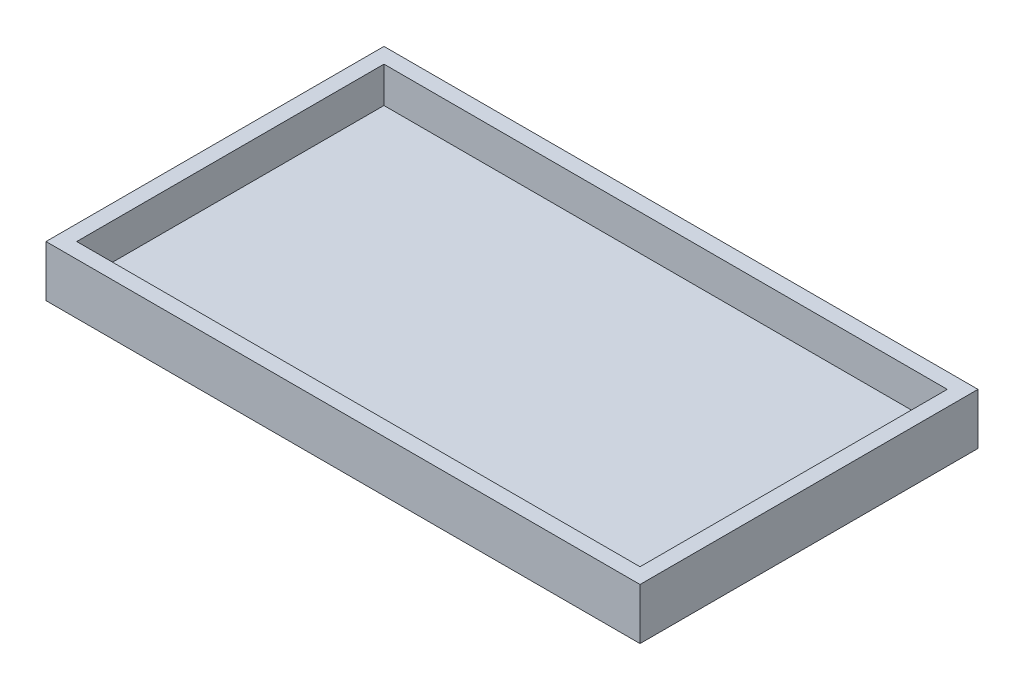
ISO-10303-21;
HEADER;
FILE_DESCRIPTION(('STEP AP214'),'2;1');
FILE_NAME('part.step','',(''),(''),'','','');
FILE_SCHEMA(('AUTOMOTIVE_DESIGN { 1 0 10303 214 1 1 1 1 }'));
ENDSEC;
DATA;
#1=APPLICATION_CONTEXT('core data for automotive mechanical design processes');
#2=APPLICATION_PROTOCOL_DEFINITION('international standard','automotive_design',2000,#1);
#3=PRODUCT_CONTEXT('',#1,'mechanical');
#4=PRODUCT('Part','Part','',(#3));
#5=PRODUCT_RELATED_PRODUCT_CATEGORY('part','',(#4));
#6=PRODUCT_DEFINITION_FORMATION('','',#4);
#7=PRODUCT_DEFINITION_CONTEXT('part definition',#1,'design');
#8=PRODUCT_DEFINITION('design','',#6,#7);
#9=PRODUCT_DEFINITION_SHAPE('','',#8);
#10=(LENGTH_UNIT() NAMED_UNIT(*) SI_UNIT(.MILLI.,.METRE.));
#11=(NAMED_UNIT(*) PLANE_ANGLE_UNIT() SI_UNIT($,.RADIAN.));
#12=(NAMED_UNIT(*) SI_UNIT($,.STERADIAN.) SOLID_ANGLE_UNIT());
#13=UNCERTAINTY_MEASURE_WITH_UNIT(LENGTH_MEASURE(1.E-05),#10,'distance_accuracy_value','');
#14=(GEOMETRIC_REPRESENTATION_CONTEXT(3) GLOBAL_UNCERTAINTY_ASSIGNED_CONTEXT((#13)) GLOBAL_UNIT_ASSIGNED_CONTEXT((#10,
#11,#12)) REPRESENTATION_CONTEXT('',''));
#15=CARTESIAN_POINT('',(0.,0.,0.));
#16=DIRECTION('',(0.,0.,1.));
#17=DIRECTION('',(1.,0.,0.));
#18=AXIS2_PLACEMENT_3D('',#15,#16,#17);
#19=CARTESIAN_POINT('',(0.,10.,0.));
#20=DIRECTION('',(0.,-1.,0.));
#21=DIRECTION('',(0.,0.,-1.));
#22=AXIS2_PLACEMENT_3D('',#19,#20,#21);
#23=PLANE('',#22);
#24=DIRECTION('',(0.,0.,1.));
#25=VECTOR('',#24,1.);
#26=CARTESIAN_POINT('',(0.,10.,0.));
#27=LINE('',#26,#25);
#28=CARTESIAN_POINT('',(0.,10.,-66.));
#29=VERTEX_POINT('',#28);
#30=CARTESIAN_POINT('',(0.,10.,0.));
#31=VERTEX_POINT('',#30);
#32=EDGE_CURVE('E141',#29,#31,#27,.T.);
#33=ORIENTED_EDGE('',*,*,#32,.T.);
#34=DIRECTION('',(1.,0.,0.));
#35=VECTOR('',#34,1.);
#36=CARTESIAN_POINT('',(0.,10.,0.));
#37=LINE('',#36,#35);
#38=CARTESIAN_POINT('',(116.,10.,0.));
#39=VERTEX_POINT('',#38);
#40=EDGE_CURVE('E85',#31,#39,#37,.T.);
#41=ORIENTED_EDGE('',*,*,#40,.T.);
#42=DIRECTION('',(0.,0.,-1.));
#43=VECTOR('',#42,1.);
#44=CARTESIAN_POINT('',(116.,10.,0.));
#45=LINE('',#44,#43);
#46=CARTESIAN_POINT('',(116.,10.,-66.));
#47=VERTEX_POINT('',#46);
#48=EDGE_CURVE('E144',#39,#47,#45,.T.);
#49=ORIENTED_EDGE('',*,*,#48,.T.);
#50=DIRECTION('',(-1.,0.,0.));
#51=VECTOR('',#50,1.);
#52=CARTESIAN_POINT('',(0.,10.,-66.));
#53=LINE('',#52,#51);
#54=EDGE_CURVE('E57',#47,#29,#53,.T.);
#55=ORIENTED_EDGE('',*,*,#54,.T.);
#56=EDGE_LOOP('',(#33,#41,#49,#55));
#57=FACE_BOUND('',#56,.T.);
#58=DIRECTION('',(0.,0.,1.));
#59=VECTOR('',#58,1.);
#60=CARTESIAN_POINT('',(3.,10.,0.));
#61=LINE('',#60,#59);
#62=CARTESIAN_POINT('',(3.,10.,-63.));
#63=VERTEX_POINT('',#62);
#64=CARTESIAN_POINT('',(3.,10.,-3.));
#65=VERTEX_POINT('',#64);
#66=EDGE_CURVE('E130',#63,#65,#61,.T.);
#67=ORIENTED_EDGE('',*,*,#66,.F.);
#68=DIRECTION('',(-1.,0.,0.));
#69=VECTOR('',#68,1.);
#70=CARTESIAN_POINT('',(0.,10.,-63.));
#71=LINE('',#70,#69);
#72=CARTESIAN_POINT('',(113.,10.,-63.));
#73=VERTEX_POINT('',#72);
#74=EDGE_CURVE('E139',#73,#63,#71,.T.);
#75=ORIENTED_EDGE('',*,*,#74,.F.);
#76=DIRECTION('',(0.,0.,-1.));
#77=VECTOR('',#76,1.);
#78=CARTESIAN_POINT('',(113.,10.,0.));
#79=LINE('',#78,#77);
#80=CARTESIAN_POINT('',(113.,10.,-3.));
#81=VERTEX_POINT('',#80);
#82=EDGE_CURVE('E137',#81,#73,#79,.T.);
#83=ORIENTED_EDGE('',*,*,#82,.F.);
#84=DIRECTION('',(1.,0.,0.));
#85=VECTOR('',#84,1.);
#86=CARTESIAN_POINT('',(0.,10.,-3.));
#87=LINE('',#86,#85);
#88=EDGE_CURVE('E122',#65,#81,#87,.T.);
#89=ORIENTED_EDGE('',*,*,#88,.F.);
#90=EDGE_LOOP('',(#67,#75,#83,#89));
#91=FACE_BOUND('',#90,.T.);
#92=ADVANCED_FACE('F33',(#57,#91),#23,.F.);
#93=CARTESIAN_POINT('',(0.,10.,0.));
#94=DIRECTION('',(1.,0.,0.));
#95=DIRECTION('',(0.,0.,-1.));
#96=AXIS2_PLACEMENT_3D('',#93,#94,#95);
#97=PLANE('',#96);
#98=DIRECTION('',(0.,0.,1.));
#99=VECTOR('',#98,1.);
#100=CARTESIAN_POINT('',(0.,0.,0.));
#101=LINE('',#100,#99);
#102=CARTESIAN_POINT('',(0.,0.,-66.));
#103=VERTEX_POINT('',#102);
#104=CARTESIAN_POINT('',(0.,0.,0.));
#105=VERTEX_POINT('',#104);
#106=EDGE_CURVE('E148',#103,#105,#101,.T.);
#107=ORIENTED_EDGE('',*,*,#106,.T.);
#108=DIRECTION('',(0.,-1.,0.));
#109=VECTOR('',#108,1.);
#110=CARTESIAN_POINT('',(0.,10.,0.));
#111=LINE('',#110,#109);
#112=EDGE_CURVE('E11',#31,#105,#111,.T.);
#113=ORIENTED_EDGE('',*,*,#112,.F.);
#114=ORIENTED_EDGE('',*,*,#32,.F.);
#115=DIRECTION('',(0.,-1.,0.));
#116=VECTOR('',#115,1.);
#117=CARTESIAN_POINT('',(0.,10.,-66.));
#118=LINE('',#117,#116);
#119=EDGE_CURVE('E147',#29,#103,#118,.T.);
#120=ORIENTED_EDGE('',*,*,#119,.T.);
#121=EDGE_LOOP('',(#107,#113,#114,#120));
#122=FACE_BOUND('',#121,.T.);
#123=ADVANCED_FACE('F35',(#122),#97,.F.);
#124=CARTESIAN_POINT('',(0.,10.,0.));
#125=DIRECTION('',(0.,0.,-1.));
#126=DIRECTION('',(-1.,0.,0.));
#127=AXIS2_PLACEMENT_3D('',#124,#125,#126);
#128=PLANE('',#127);
#129=DIRECTION('',(1.,0.,0.));
#130=VECTOR('',#129,1.);
#131=CARTESIAN_POINT('',(0.,0.,0.));
#132=LINE('',#131,#130);
#133=CARTESIAN_POINT('',(116.,0.,0.));
#134=VERTEX_POINT('',#133);
#135=EDGE_CURVE('E151',#105,#134,#132,.T.);
#136=ORIENTED_EDGE('',*,*,#135,.T.);
#137=DIRECTION('',(0.,-1.,0.));
#138=VECTOR('',#137,1.);
#139=CARTESIAN_POINT('',(116.,10.,0.));
#140=LINE('',#139,#138);
#141=EDGE_CURVE('E41',#39,#134,#140,.T.);
#142=ORIENTED_EDGE('',*,*,#141,.F.);
#143=ORIENTED_EDGE('',*,*,#40,.F.);
#144=ORIENTED_EDGE('',*,*,#112,.T.);
#145=EDGE_LOOP('',(#136,#142,#143,#144));
#146=FACE_BOUND('',#145,.T.);
#147=ADVANCED_FACE('F179',(#146),#128,.F.);
#148=CARTESIAN_POINT('',(116.,10.,0.));
#149=DIRECTION('',(-1.,0.,0.));
#150=DIRECTION('',(0.,0.,1.));
#151=AXIS2_PLACEMENT_3D('',#148,#149,#150);
#152=PLANE('',#151);
#153=DIRECTION('',(0.,0.,-1.));
#154=VECTOR('',#153,1.);
#155=CARTESIAN_POINT('',(116.,0.,0.));
#156=LINE('',#155,#154);
#157=CARTESIAN_POINT('',(116.,0.,-66.));
#158=VERTEX_POINT('',#157);
#159=EDGE_CURVE('E153',#134,#158,#156,.T.);
#160=ORIENTED_EDGE('',*,*,#159,.T.);
#161=DIRECTION('',(0.,-1.,0.));
#162=VECTOR('',#161,1.);
#163=CARTESIAN_POINT('',(116.,10.,-66.));
#164=LINE('',#163,#162);
#165=EDGE_CURVE('E157',#47,#158,#164,.T.);
#166=ORIENTED_EDGE('',*,*,#165,.F.);
#167=ORIENTED_EDGE('',*,*,#48,.F.);
#168=ORIENTED_EDGE('',*,*,#141,.T.);
#169=EDGE_LOOP('',(#160,#166,#167,#168));
#170=FACE_BOUND('',#169,.T.);
#171=ADVANCED_FACE('F162',(#170),#152,.F.);
#172=CARTESIAN_POINT('',(0.,10.,-66.));
#173=DIRECTION('',(0.,0.,1.));
#174=DIRECTION('',(1.,0.,0.));
#175=AXIS2_PLACEMENT_3D('',#172,#173,#174);
#176=PLANE('',#175);
#177=DIRECTION('',(-1.,0.,0.));
#178=VECTOR('',#177,1.);
#179=CARTESIAN_POINT('',(0.,0.,-66.));
#180=LINE('',#179,#178);
#181=EDGE_CURVE('E78',#158,#103,#180,.T.);
#182=ORIENTED_EDGE('',*,*,#181,.T.);
#183=ORIENTED_EDGE('',*,*,#119,.F.);
#184=ORIENTED_EDGE('',*,*,#54,.F.);
#185=ORIENTED_EDGE('',*,*,#165,.T.);
#186=EDGE_LOOP('',(#182,#183,#184,#185));
#187=FACE_BOUND('',#186,.T.);
#188=ADVANCED_FACE('F170',(#187),#176,.F.);
#189=CARTESIAN_POINT('',(0.,0.,0.));
#190=DIRECTION('',(0.,-1.,0.));
#191=DIRECTION('',(0.,0.,-1.));
#192=AXIS2_PLACEMENT_3D('',#189,#190,#191);
#193=PLANE('',#192);
#194=ORIENTED_EDGE('',*,*,#106,.F.);
#195=ORIENTED_EDGE('',*,*,#181,.F.);
#196=ORIENTED_EDGE('',*,*,#159,.F.);
#197=ORIENTED_EDGE('',*,*,#135,.F.);
#198=EDGE_LOOP('',(#194,#195,#196,#197));
#199=FACE_BOUND('',#198,.T.);
#200=ADVANCED_FACE('F166',(#199),#193,.T.);
#201=CARTESIAN_POINT('',(3.,10.,0.));
#202=DIRECTION('',(1.,0.,0.));
#203=DIRECTION('',(0.,0.,-1.));
#204=AXIS2_PLACEMENT_3D('',#201,#202,#203);
#205=PLANE('',#204);
#206=DIRECTION('',(0.,0.,1.));
#207=VECTOR('',#206,1.);
#208=CARTESIAN_POINT('',(3.,3.,0.));
#209=LINE('',#208,#207);
#210=CARTESIAN_POINT('',(3.,3.,-63.));
#211=VERTEX_POINT('',#210);
#212=CARTESIAN_POINT('',(3.,3.,-3.));
#213=VERTEX_POINT('',#212);
#214=EDGE_CURVE('E113',#211,#213,#209,.T.);
#215=ORIENTED_EDGE('',*,*,#214,.F.);
#216=DIRECTION('',(0.,-1.,0.));
#217=VECTOR('',#216,1.);
#218=CARTESIAN_POINT('',(3.,10.,-63.));
#219=LINE('',#218,#217);
#220=EDGE_CURVE('E133',#63,#211,#219,.T.);
#221=ORIENTED_EDGE('',*,*,#220,.F.);
#222=ORIENTED_EDGE('',*,*,#66,.T.);
#223=DIRECTION('',(0.,-1.,0.));
#224=VECTOR('',#223,1.);
#225=CARTESIAN_POINT('',(3.,10.,-3.));
#226=LINE('',#225,#224);
#227=EDGE_CURVE('E125',#65,#213,#226,.T.);
#228=ORIENTED_EDGE('',*,*,#227,.T.);
#229=EDGE_LOOP('',(#215,#221,#222,#228));
#230=FACE_BOUND('',#229,.T.);
#231=ADVANCED_FACE('F177',(#230),#205,.T.);
#232=CARTESIAN_POINT('',(0.,10.,-3.));
#233=DIRECTION('',(0.,0.,-1.));
#234=DIRECTION('',(-1.,0.,0.));
#235=AXIS2_PLACEMENT_3D('',#232,#233,#234);
#236=PLANE('',#235);
#237=DIRECTION('',(1.,0.,0.));
#238=VECTOR('',#237,1.);
#239=CARTESIAN_POINT('',(0.,3.,-3.));
#240=LINE('',#239,#238);
#241=CARTESIAN_POINT('',(113.,3.,-3.));
#242=VERTEX_POINT('',#241);
#243=EDGE_CURVE('E107',#213,#242,#240,.T.);
#244=ORIENTED_EDGE('',*,*,#243,.F.);
#245=ORIENTED_EDGE('',*,*,#227,.F.);
#246=ORIENTED_EDGE('',*,*,#88,.T.);
#247=DIRECTION('',(0.,-1.,0.));
#248=VECTOR('',#247,1.);
#249=CARTESIAN_POINT('',(113.,10.,-3.));
#250=LINE('',#249,#248);
#251=EDGE_CURVE('E119',#81,#242,#250,.T.);
#252=ORIENTED_EDGE('',*,*,#251,.T.);
#253=EDGE_LOOP('',(#244,#245,#246,#252));
#254=FACE_BOUND('',#253,.T.);
#255=ADVANCED_FACE('F120',(#254),#236,.T.);
#256=CARTESIAN_POINT('',(113.,10.,0.));
#257=DIRECTION('',(-1.,0.,0.));
#258=DIRECTION('',(0.,0.,1.));
#259=AXIS2_PLACEMENT_3D('',#256,#257,#258);
#260=PLANE('',#259);
#261=DIRECTION('',(0.,0.,-1.));
#262=VECTOR('',#261,1.);
#263=CARTESIAN_POINT('',(113.,3.,0.));
#264=LINE('',#263,#262);
#265=CARTESIAN_POINT('',(113.,3.,-63.));
#266=VERTEX_POINT('',#265);
#267=EDGE_CURVE('E111',#242,#266,#264,.T.);
#268=ORIENTED_EDGE('',*,*,#267,.F.);
#269=ORIENTED_EDGE('',*,*,#251,.F.);
#270=ORIENTED_EDGE('',*,*,#82,.T.);
#271=DIRECTION('',(0.,-1.,0.));
#272=VECTOR('',#271,1.);
#273=CARTESIAN_POINT('',(113.,10.,-63.));
#274=LINE('',#273,#272);
#275=EDGE_CURVE('E48',#73,#266,#274,.T.);
#276=ORIENTED_EDGE('',*,*,#275,.T.);
#277=EDGE_LOOP('',(#268,#269,#270,#276));
#278=FACE_BOUND('',#277,.T.);
#279=ADVANCED_FACE('F127',(#278),#260,.T.);
#280=CARTESIAN_POINT('',(0.,10.,-63.));
#281=DIRECTION('',(0.,0.,1.));
#282=DIRECTION('',(1.,0.,0.));
#283=AXIS2_PLACEMENT_3D('',#280,#281,#282);
#284=PLANE('',#283);
#285=DIRECTION('',(-1.,0.,0.));
#286=VECTOR('',#285,1.);
#287=CARTESIAN_POINT('',(0.,3.,-63.));
#288=LINE('',#287,#286);
#289=EDGE_CURVE('E128',#266,#211,#288,.T.);
#290=ORIENTED_EDGE('',*,*,#289,.F.);
#291=ORIENTED_EDGE('',*,*,#275,.F.);
#292=ORIENTED_EDGE('',*,*,#74,.T.);
#293=ORIENTED_EDGE('',*,*,#220,.T.);
#294=EDGE_LOOP('',(#290,#291,#292,#293));
#295=FACE_BOUND('',#294,.T.);
#296=ADVANCED_FACE('F190',(#295),#284,.T.);
#297=CARTESIAN_POINT('',(0.,3.,0.));
#298=DIRECTION('',(0.,-1.,0.));
#299=DIRECTION('',(0.,0.,-1.));
#300=AXIS2_PLACEMENT_3D('',#297,#298,#299);
#301=PLANE('',#300);
#302=ORIENTED_EDGE('',*,*,#214,.T.);
#303=ORIENTED_EDGE('',*,*,#243,.T.);
#304=ORIENTED_EDGE('',*,*,#267,.T.);
#305=ORIENTED_EDGE('',*,*,#289,.T.);
#306=EDGE_LOOP('',(#302,#303,#304,#305));
#307=FACE_BOUND('',#306,.T.);
#308=ADVANCED_FACE('F109',(#307),#301,.F.);
#309=CLOSED_SHELL('',(#92,#123,#147,#171,#188,#200,#231,#255,#279,#296,#308));
#310=MANIFOLD_SOLID_BREP('B2',#309);
#311=ADVANCED_BREP_SHAPE_REPRESENTATION('',(#18,#310),#14);
#312=SHAPE_DEFINITION_REPRESENTATION(#9,#311);
ENDSEC;
END-ISO-10303-21;
